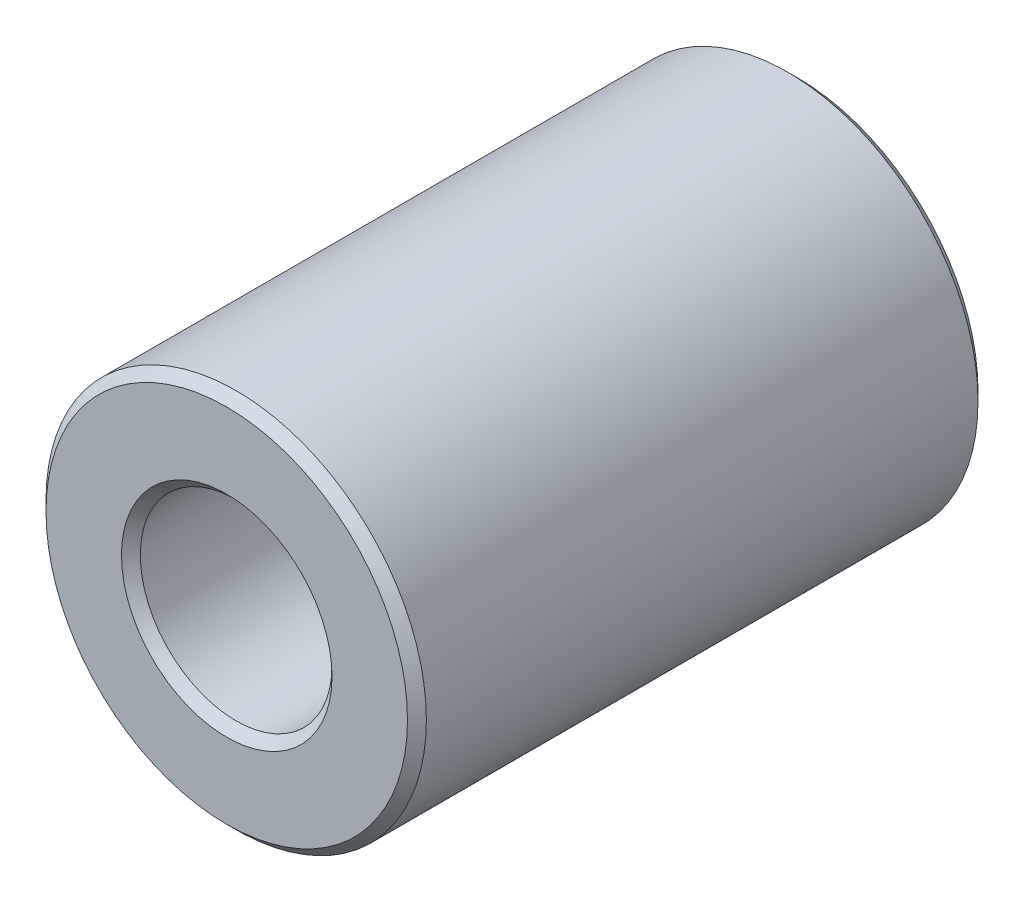
ISO-10303-21;
HEADER;
FILE_DESCRIPTION(('STEP AP214'),'2;1');
FILE_NAME('part.step','',(''),(''),'','','');
FILE_SCHEMA(('AUTOMOTIVE_DESIGN { 1 0 10303 214 1 1 1 1 }'));
ENDSEC;
DATA;
#1=APPLICATION_CONTEXT('core data for automotive mechanical design processes');
#2=APPLICATION_PROTOCOL_DEFINITION('international standard','automotive_design',2000,#1);
#3=PRODUCT_CONTEXT('',#1,'mechanical');
#4=PRODUCT('Part','Part','',(#3));
#5=PRODUCT_RELATED_PRODUCT_CATEGORY('part','',(#4));
#6=PRODUCT_DEFINITION_FORMATION('','',#4);
#7=PRODUCT_DEFINITION_CONTEXT('part definition',#1,'design');
#8=PRODUCT_DEFINITION('design','',#6,#7);
#9=PRODUCT_DEFINITION_SHAPE('','',#8);
#10=(LENGTH_UNIT() NAMED_UNIT(*) SI_UNIT(.MILLI.,.METRE.));
#11=(NAMED_UNIT(*) PLANE_ANGLE_UNIT() SI_UNIT($,.RADIAN.));
#12=(NAMED_UNIT(*) SI_UNIT($,.STERADIAN.) SOLID_ANGLE_UNIT());
#13=UNCERTAINTY_MEASURE_WITH_UNIT(LENGTH_MEASURE(1.E-05),#10,'distance_accuracy_value','');
#14=(GEOMETRIC_REPRESENTATION_CONTEXT(3) GLOBAL_UNCERTAINTY_ASSIGNED_CONTEXT((#13)) GLOBAL_UNIT_ASSIGNED_CONTEXT((#10,
#11,#12)) REPRESENTATION_CONTEXT('',''));
#15=CARTESIAN_POINT('',(0.,0.,0.));
#16=DIRECTION('',(0.,0.,1.));
#17=DIRECTION('',(1.,0.,0.));
#18=AXIS2_PLACEMENT_3D('',#15,#16,#17);
#19=CARTESIAN_POINT('',(0.,0.,-9.525));
#20=DIRECTION('',(0.,0.,1.));
#21=DIRECTION('',(1.,0.,0.));
#22=AXIS2_PLACEMENT_3D('',#19,#20,#21);
#23=CYLINDRICAL_SURFACE('',#22,6.35);
#24=CARTESIAN_POINT('',(0.,0.,9.21004000000001));
#25=DIRECTION('',(0.,0.,1.));
#26=DIRECTION('',(1.,0.,0.));
#27=AXIS2_PLACEMENT_3D('',#24,#25,#26);
#28=CIRCLE('',#27,6.35);
#29=CARTESIAN_POINT('',(6.35,0.,9.21004));
#30=VERTEX_POINT('',#29);
#31=EDGE_CURVE('E63',#30,#30,#28,.F.);
#32=CARTESIAN_POINT('',(0.,0.,-9.21003999999999));
#33=DIRECTION('',(0.,0.,1.));
#34=DIRECTION('',(1.,0.,0.));
#35=AXIS2_PLACEMENT_3D('',#32,#33,#34);
#36=CIRCLE('',#35,6.35);
#37=CARTESIAN_POINT('',(6.35,0.,-9.21003999999999));
#38=VERTEX_POINT('',#37);
#39=EDGE_CURVE('E67',#38,#38,#36,.T.);
#40=CARTESIAN_POINT('',(6.35,0.,9.21004));
#41=CARTESIAN_POINT('',(6.35,0.,9.01816416666667));
#42=CARTESIAN_POINT('',(6.35,0.,8.82628833333334));
#43=CARTESIAN_POINT('',(6.35,0.,8.44253666666667));
#44=CARTESIAN_POINT('',(6.35,0.,8.25066083333334));
#45=CARTESIAN_POINT('',(6.35,0.,7.86690916666667));
#46=CARTESIAN_POINT('',(6.35,0.,7.67503333333334));
#47=CARTESIAN_POINT('',(6.35,0.,7.29128166666667));
#48=CARTESIAN_POINT('',(6.35,0.,7.09940583333334));
#49=CARTESIAN_POINT('',(6.35,0.,6.71565416666667));
#50=CARTESIAN_POINT('',(6.35,0.,6.52377833333334));
#51=CARTESIAN_POINT('',(6.35,0.,6.14002666666667));
#52=CARTESIAN_POINT('',(6.35,0.,5.94815083333334));
#53=CARTESIAN_POINT('',(6.35,0.,5.56439916666667));
#54=CARTESIAN_POINT('',(6.35,0.,5.37252333333334));
#55=CARTESIAN_POINT('',(6.35,0.,4.98877166666667));
#56=CARTESIAN_POINT('',(6.35,0.,4.79689583333334));
#57=CARTESIAN_POINT('',(6.35,0.,4.41314416666667));
#58=CARTESIAN_POINT('',(6.35,0.,4.22126833333334));
#59=CARTESIAN_POINT('',(6.35,0.,3.83751666666667));
#60=CARTESIAN_POINT('',(6.35,0.,3.64564083333334));
#61=CARTESIAN_POINT('',(6.35,0.,3.26188916666667));
#62=CARTESIAN_POINT('',(6.35,0.,3.07001333333334));
#63=CARTESIAN_POINT('',(6.35,0.,2.68626166666667));
#64=CARTESIAN_POINT('',(6.35,0.,2.49438583333334));
#65=CARTESIAN_POINT('',(6.35,0.,2.11063416666667));
#66=CARTESIAN_POINT('',(6.35,0.,1.91875833333334));
#67=CARTESIAN_POINT('',(6.35,0.,1.53500666666668));
#68=CARTESIAN_POINT('',(6.35,0.,1.34313083333334));
#69=CARTESIAN_POINT('',(6.35,0.,0.959379166666676));
#70=CARTESIAN_POINT('',(6.35,0.,0.767503333333342));
#71=CARTESIAN_POINT('',(6.35,0.,0.383751666666675));
#72=CARTESIAN_POINT('',(6.35,0.,0.191875833333342));
#73=CARTESIAN_POINT('',(6.35,0.,-0.191875833333325));
#74=CARTESIAN_POINT('',(6.35,0.,-0.383751666666658));
#75=CARTESIAN_POINT('',(6.35,0.,-0.767503333333325));
#76=CARTESIAN_POINT('',(6.35,0.,-0.959379166666658));
#77=CARTESIAN_POINT('',(6.35,0.,-1.34313083333332));
#78=CARTESIAN_POINT('',(6.35,0.,-1.53500666666666));
#79=CARTESIAN_POINT('',(6.35,0.,-1.91875833333332));
#80=CARTESIAN_POINT('',(6.35,0.,-2.11063416666666));
#81=CARTESIAN_POINT('',(6.35,0.,-2.49438583333332));
#82=CARTESIAN_POINT('',(6.35,0.,-2.68626166666666));
#83=CARTESIAN_POINT('',(6.35,0.,-3.07001333333332));
#84=CARTESIAN_POINT('',(6.35,0.,-3.26188916666666));
#85=CARTESIAN_POINT('',(6.35,0.,-3.64564083333332));
#86=CARTESIAN_POINT('',(6.35,0.,-3.83751666666666));
#87=CARTESIAN_POINT('',(6.35,0.,-4.22126833333332));
#88=CARTESIAN_POINT('',(6.35,0.,-4.41314416666666));
#89=CARTESIAN_POINT('',(6.35,0.,-4.79689583333332));
#90=CARTESIAN_POINT('',(6.35,0.,-4.98877166666666));
#91=CARTESIAN_POINT('',(6.35,0.,-5.37252333333332));
#92=CARTESIAN_POINT('',(6.35,0.,-5.56439916666665));
#93=CARTESIAN_POINT('',(6.35,0.,-5.94815083333332));
#94=CARTESIAN_POINT('',(6.35,0.,-6.14002666666665));
#95=CARTESIAN_POINT('',(6.35,0.,-6.52377833333332));
#96=CARTESIAN_POINT('',(6.35,0.,-6.71565416666665));
#97=CARTESIAN_POINT('',(6.35,0.,-7.09940583333332));
#98=CARTESIAN_POINT('',(6.35,0.,-7.29128166666665));
#99=CARTESIAN_POINT('',(6.35,0.,-7.67503333333332));
#100=CARTESIAN_POINT('',(6.35,0.,-7.86690916666665));
#101=CARTESIAN_POINT('',(6.35,0.,-8.25066083333332));
#102=CARTESIAN_POINT('',(6.35,0.,-8.44253666666665));
#103=CARTESIAN_POINT('',(6.35,0.,-8.82628833333332));
#104=CARTESIAN_POINT('',(6.35,0.,-9.01816416666665));
#105=CARTESIAN_POINT('',(6.35,0.,-9.21003999999999));
#106=B_SPLINE_CURVE_WITH_KNOTS('',3,(#40,#41,#42,#43,#44,#45,#46,#47,#48,#49,#50,#51,#52,#53,
#54,#55,#56,#57,#58,#59,#60,#61,#62,#63,#64,#65,#66,#67,#68,#69,#70,#71,#72,#73,#74,#75,#76,#77,
#78,#79,#80,#81,#82,#83,#84,#85,#86,#87,#88,#89,#90,#91,#92,#93,#94,#95,#96,#97,#98,#99,#100,
#101,#102,#103,#104,#105),.UNSPECIFIED.,.F.,.F.,(4,2,2,2,2,2,2,2,2,2,2,2,2,2,2,2,2,2,2,2,2,2,2,
2,2,2,2,2,2,2,2,2,4),(0.,0.575627499999998,1.151255,1.7268825,2.30251,2.8781375,3.453765,
4.0293925,4.60502,5.1806475,5.756275,6.3319025,6.90753,7.4831575,8.05878499999999,8.6344125,
9.21004,9.7856675,10.361295,10.9369225,11.51255,12.0881775,12.663805,13.2394325,13.81506,
14.3906875,14.966315,15.5419425,16.11757,16.6931975,17.268825,17.8444525,18.42008),.UNSPECIFIED.);
#107=EDGE_CURVE('BSEAM39',#30,#38,#106,.T.);
#108=ORIENTED_EDGE('',*,*,#31,.T.);
#109=ORIENTED_EDGE('',*,*,#39,.T.);
#110=ORIENTED_EDGE('',*,*,#107,.T.);
#111=ORIENTED_EDGE('',*,*,#107,.F.);
#112=EDGE_LOOP('',(#108,#110,#109,#111));
#113=FACE_BOUND('',#112,.T.);
#114=ADVANCED_FACE('F39',(#113),#23,.T.);
#115=CARTESIAN_POINT('',(0.,0.,-9.525));
#116=DIRECTION('',(0.,0.,1.));
#117=DIRECTION('',(1.,0.,0.));
#118=AXIS2_PLACEMENT_3D('',#115,#116,#117);
#119=PLANE('',#118);
#120=CARTESIAN_POINT('',(0.,0.,-9.525));
#121=DIRECTION('',(0.,0.,1.));
#122=DIRECTION('',(1.,0.,0.));
#123=AXIS2_PLACEMENT_3D('',#120,#121,#122);
#124=CIRCLE('',#123,6.03503999999998);
#125=CARTESIAN_POINT('',(6.03503999999998,0.,-9.525));
#126=VERTEX_POINT('',#125);
#127=EDGE_CURVE('E52',#126,#126,#124,.F.);
#128=ORIENTED_EDGE('',*,*,#127,.T.);
#129=EDGE_LOOP('',(#128));
#130=FACE_BOUND('',#129,.T.);
#131=CARTESIAN_POINT('',(0.,0.,-9.525));
#132=DIRECTION('',(0.,0.,1.));
#133=DIRECTION('',(1.,0.,0.));
#134=AXIS2_PLACEMENT_3D('',#131,#132,#133);
#135=CIRCLE('',#134,3.51535999999999);
#136=CARTESIAN_POINT('',(3.51535999999999,0.,-9.525));
#137=VERTEX_POINT('',#136);
#138=EDGE_CURVE('E57',#137,#137,#135,.T.);
#139=ORIENTED_EDGE('',*,*,#138,.T.);
#140=EDGE_LOOP('',(#139));
#141=FACE_BOUND('',#140,.T.);
#142=ADVANCED_FACE('F95',(#130,#141),#119,.F.);
#143=CARTESIAN_POINT('',(0.,0.,-9.525));
#144=DIRECTION('',(0.,0.,1.));
#145=DIRECTION('',(1.,0.,0.));
#146=AXIS2_PLACEMENT_3D('',#143,#144,#145);
#147=CYLINDRICAL_SURFACE('',#146,3.2004);
#148=CARTESIAN_POINT('',(0.,0.,9.21003999999999));
#149=DIRECTION('',(0.,0.,1.));
#150=DIRECTION('',(1.,0.,0.));
#151=AXIS2_PLACEMENT_3D('',#148,#149,#150);
#152=CIRCLE('',#151,3.2004);
#153=CARTESIAN_POINT('',(3.2004,0.,9.21003999999999));
#154=VERTEX_POINT('',#153);
#155=EDGE_CURVE('E10',#154,#154,#152,.T.);
#156=CARTESIAN_POINT('',(0.,0.,-9.21004000000002));
#157=DIRECTION('',(0.,0.,1.));
#158=DIRECTION('',(1.,0.,0.));
#159=AXIS2_PLACEMENT_3D('',#156,#157,#158);
#160=CIRCLE('',#159,3.2004);
#161=CARTESIAN_POINT('',(3.2004,0.,-9.21004000000002));
#162=VERTEX_POINT('',#161);
#163=EDGE_CURVE('E47',#162,#162,#160,.F.);
#164=CARTESIAN_POINT('',(3.2004,0.,9.21003999999999));
#165=CARTESIAN_POINT('',(3.2004,0.,9.01816416666666));
#166=CARTESIAN_POINT('',(3.2004,0.,8.82628833333332));
#167=CARTESIAN_POINT('',(3.2004,0.,8.44253666666666));
#168=CARTESIAN_POINT('',(3.2004,0.,8.25066083333332));
#169=CARTESIAN_POINT('',(3.2004,0.,7.86690916666666));
#170=CARTESIAN_POINT('',(3.2004,0.,7.67503333333332));
#171=CARTESIAN_POINT('',(3.2004,0.,7.29128166666665));
#172=CARTESIAN_POINT('',(3.2004,0.,7.09940583333332));
#173=CARTESIAN_POINT('',(3.2004,0.,6.71565416666666));
#174=CARTESIAN_POINT('',(3.2004,0.,6.52377833333332));
#175=CARTESIAN_POINT('',(3.2004,0.,6.14002666666665));
#176=CARTESIAN_POINT('',(3.2004,0.,5.94815083333332));
#177=CARTESIAN_POINT('',(3.2004,0.,5.56439916666666));
#178=CARTESIAN_POINT('',(3.2004,0.,5.37252333333332));
#179=CARTESIAN_POINT('',(3.2004,0.,4.98877166666666));
#180=CARTESIAN_POINT('',(3.2004,0.,4.79689583333332));
#181=CARTESIAN_POINT('',(3.2004,0.,4.41314416666666));
#182=CARTESIAN_POINT('',(3.2004,0.,4.22126833333332));
#183=CARTESIAN_POINT('',(3.2004,0.,3.83751666666666));
#184=CARTESIAN_POINT('',(3.2004,0.,3.64564083333332));
#185=CARTESIAN_POINT('',(3.2004,0.,3.26188916666666));
#186=CARTESIAN_POINT('',(3.2004,0.,3.07001333333332));
#187=CARTESIAN_POINT('',(3.2004,0.,2.68626166666665));
#188=CARTESIAN_POINT('',(3.2004,0.,2.49438583333332));
#189=CARTESIAN_POINT('',(3.2004,0.,2.11063416666665));
#190=CARTESIAN_POINT('',(3.2004,0.,1.91875833333332));
#191=CARTESIAN_POINT('',(3.2004,0.,1.53500666666665));
#192=CARTESIAN_POINT('',(3.2004,0.,1.34313083333332));
#193=CARTESIAN_POINT('',(3.2004,0.,0.959379166666653));
#194=CARTESIAN_POINT('',(3.2004,0.,0.76750333333332));
#195=CARTESIAN_POINT('',(3.2004,0.,0.383751666666653));
#196=CARTESIAN_POINT('',(3.2004,0.,0.19187583333332));
#197=CARTESIAN_POINT('',(3.2004,0.,-0.191875833333347));
#198=CARTESIAN_POINT('',(3.2004,0.,-0.383751666666681));
#199=CARTESIAN_POINT('',(3.2004,0.,-0.767503333333347));
#200=CARTESIAN_POINT('',(3.2004,0.,-0.959379166666681));
#201=CARTESIAN_POINT('',(3.2004,0.,-1.34313083333335));
#202=CARTESIAN_POINT('',(3.2004,0.,-1.53500666666668));
#203=CARTESIAN_POINT('',(3.2004,0.,-1.91875833333335));
#204=CARTESIAN_POINT('',(3.2004,0.,-2.11063416666668));
#205=CARTESIAN_POINT('',(3.2004,0.,-2.49438583333335));
#206=CARTESIAN_POINT('',(3.2004,0.,-2.68626166666668));
#207=CARTESIAN_POINT('',(3.2004,0.,-3.07001333333335));
#208=CARTESIAN_POINT('',(3.2004,0.,-3.26188916666668));
#209=CARTESIAN_POINT('',(3.2004,0.,-3.64564083333335));
#210=CARTESIAN_POINT('',(3.2004,0.,-3.83751666666668));
#211=CARTESIAN_POINT('',(3.2004,0.,-4.22126833333335));
#212=CARTESIAN_POINT('',(3.2004,0.,-4.41314416666668));
#213=CARTESIAN_POINT('',(3.2004,0.,-4.79689583333335));
#214=CARTESIAN_POINT('',(3.2004,0.,-4.98877166666668));
#215=CARTESIAN_POINT('',(3.2004,0.,-5.37252333333335));
#216=CARTESIAN_POINT('',(3.2004,0.,-5.56439916666668));
#217=CARTESIAN_POINT('',(3.2004,0.,-5.94815083333335));
#218=CARTESIAN_POINT('',(3.2004,0.,-6.14002666666668));
#219=CARTESIAN_POINT('',(3.2004,0.,-6.52377833333335));
#220=CARTESIAN_POINT('',(3.2004,0.,-6.71565416666668));
#221=CARTESIAN_POINT('',(3.2004,0.,-7.09940583333335));
#222=CARTESIAN_POINT('',(3.2004,0.,-7.29128166666668));
#223=CARTESIAN_POINT('',(3.2004,0.,-7.67503333333335));
#224=CARTESIAN_POINT('',(3.2004,0.,-7.86690916666668));
#225=CARTESIAN_POINT('',(3.2004,0.,-8.25066083333335));
#226=CARTESIAN_POINT('',(3.2004,0.,-8.44253666666669));
#227=CARTESIAN_POINT('',(3.2004,0.,-8.82628833333335));
#228=CARTESIAN_POINT('',(3.2004,0.,-9.01816416666668));
#229=CARTESIAN_POINT('',(3.2004,0.,-9.21004000000002));
#230=B_SPLINE_CURVE_WITH_KNOTS('',3,(#164,#165,#166,#167,#168,#169,#170,#171,#172,#173,#174,
#175,#176,#177,#178,#179,#180,#181,#182,#183,#184,#185,#186,#187,#188,#189,#190,#191,#192,#193,
#194,#195,#196,#197,#198,#199,#200,#201,#202,#203,#204,#205,#206,#207,#208,#209,#210,#211,#212,
#213,#214,#215,#216,#217,#218,#219,#220,#221,#222,#223,#224,#225,#226,#227,#228,#229),
.UNSPECIFIED.,.F.,.F.,(4,2,2,2,2,2,2,2,2,2,2,2,2,2,2,2,2,2,2,2,2,2,2,2,2,2,2,2,2,2,2,2,4),(0.,
0.575627500000002,1.151255,1.7268825,2.30251,2.8781375,3.453765,4.0293925,4.60502,5.1806475,
5.756275,6.3319025,6.90753,7.4831575,8.058785,8.6344125,9.21004,9.7856675,10.361295,10.9369225,
11.51255,12.0881775,12.663805,13.2394325,13.81506,14.3906875,14.966315,15.5419425,16.11757,
16.6931975,17.268825,17.8444525,18.42008),.UNSPECIFIED.);
#231=EDGE_CURVE('BSEAM101',#154,#162,#230,.T.);
#232=ORIENTED_EDGE('',*,*,#155,.T.);
#233=ORIENTED_EDGE('',*,*,#163,.T.);
#234=ORIENTED_EDGE('',*,*,#231,.T.);
#235=ORIENTED_EDGE('',*,*,#231,.F.);
#236=EDGE_LOOP('',(#232,#234,#233,#235));
#237=FACE_BOUND('',#236,.T.);
#238=ADVANCED_FACE('F101',(#237),#147,.F.);
#239=CARTESIAN_POINT('',(0.,0.,9.525));
#240=DIRECTION('',(0.,0.,1.));
#241=DIRECTION('',(1.,0.,0.));
#242=AXIS2_PLACEMENT_3D('',#239,#240,#241);
#243=PLANE('',#242);
#244=CARTESIAN_POINT('',(0.,0.,9.525));
#245=DIRECTION('',(0.,0.,1.));
#246=DIRECTION('',(1.,0.,0.));
#247=AXIS2_PLACEMENT_3D('',#244,#245,#246);
#248=CIRCLE('',#247,6.03504000000001);
#249=CARTESIAN_POINT('',(6.03504000000001,0.,9.525));
#250=VERTEX_POINT('',#249);
#251=EDGE_CURVE('E71',#250,#250,#248,.T.);
#252=ORIENTED_EDGE('',*,*,#251,.T.);
#253=EDGE_LOOP('',(#252));
#254=FACE_BOUND('',#253,.T.);
#255=CARTESIAN_POINT('',(0.,0.,9.525));
#256=DIRECTION('',(0.,0.,1.));
#257=DIRECTION('',(1.,0.,0.));
#258=AXIS2_PLACEMENT_3D('',#255,#256,#257);
#259=CIRCLE('',#258,3.51536000000001);
#260=CARTESIAN_POINT('',(3.51536000000001,0.,9.525));
#261=VERTEX_POINT('',#260);
#262=EDGE_CURVE('E75',#261,#261,#259,.F.);
#263=ORIENTED_EDGE('',*,*,#262,.T.);
#264=EDGE_LOOP('',(#263));
#265=FACE_BOUND('',#264,.T.);
#266=ADVANCED_FACE('F80',(#254,#265),#243,.T.);
#267=CARTESIAN_POINT('',(0.,0.,9.525));
#268=DIRECTION('',(0.,0.,-1.));
#269=DIRECTION('',(-1.,0.,0.));
#270=AXIS2_PLACEMENT_3D('',#267,#268,#269);
#271=CONICAL_SURFACE('',#270,6.03504000000001,0.785398163397447);
#272=ORIENTED_EDGE('',*,*,#31,.F.);
#273=EDGE_LOOP('',(#272));
#274=FACE_BOUND('',#273,.T.);
#275=ORIENTED_EDGE('',*,*,#251,.F.);
#276=EDGE_LOOP('',(#275));
#277=FACE_BOUND('',#276,.T.);
#278=ADVANCED_FACE('F91',(#274,#277),#271,.T.);
#279=CARTESIAN_POINT('',(0.,0.,-9.21003999999999));
#280=DIRECTION('',(0.,0.,1.));
#281=DIRECTION('',(1.,0.,0.));
#282=AXIS2_PLACEMENT_3D('',#279,#280,#281);
#283=CONICAL_SURFACE('',#282,6.35,0.785398163397457);
#284=ORIENTED_EDGE('',*,*,#127,.F.);
#285=EDGE_LOOP('',(#284));
#286=FACE_BOUND('',#285,.T.);
#287=ORIENTED_EDGE('',*,*,#39,.F.);
#288=EDGE_LOOP('',(#287));
#289=FACE_BOUND('',#288,.T.);
#290=ADVANCED_FACE('F85',(#286,#289),#283,.T.);
#291=CARTESIAN_POINT('',(0.,0.,9.21003999999999));
#292=DIRECTION('',(0.,0.,1.));
#293=DIRECTION('',(1.,0.,0.));
#294=AXIS2_PLACEMENT_3D('',#291,#292,#293);
#295=CONICAL_SURFACE('',#294,3.2004,0.785398163397457);
#296=ORIENTED_EDGE('',*,*,#262,.F.);
#297=EDGE_LOOP('',(#296));
#298=FACE_BOUND('',#297,.T.);
#299=ORIENTED_EDGE('',*,*,#155,.F.);
#300=EDGE_LOOP('',(#299));
#301=FACE_BOUND('',#300,.T.);
#302=ADVANCED_FACE('F82',(#298,#301),#295,.F.);
#303=CARTESIAN_POINT('',(0.,0.,-9.525));
#304=DIRECTION('',(0.,0.,-1.));
#305=DIRECTION('',(-1.,0.,0.));
#306=AXIS2_PLACEMENT_3D('',#303,#304,#305);
#307=CONICAL_SURFACE('',#306,3.51535999999999,0.785398163397452);
#308=ORIENTED_EDGE('',*,*,#163,.F.);
#309=EDGE_LOOP('',(#308));
#310=FACE_BOUND('',#309,.T.);
#311=ORIENTED_EDGE('',*,*,#138,.F.);
#312=EDGE_LOOP('',(#311));
#313=FACE_BOUND('',#312,.T.);
#314=ADVANCED_FACE('F41',(#310,#313),#307,.F.);
#315=CLOSED_SHELL('',(#114,#142,#238,#266,#278,#290,#302,#314));
#316=MANIFOLD_SOLID_BREP('B2',#315);
#317=ADVANCED_BREP_SHAPE_REPRESENTATION('',(#18,#316),#14);
#318=SHAPE_DEFINITION_REPRESENTATION(#9,#317);
ENDSEC;
END-ISO-10303-21;
